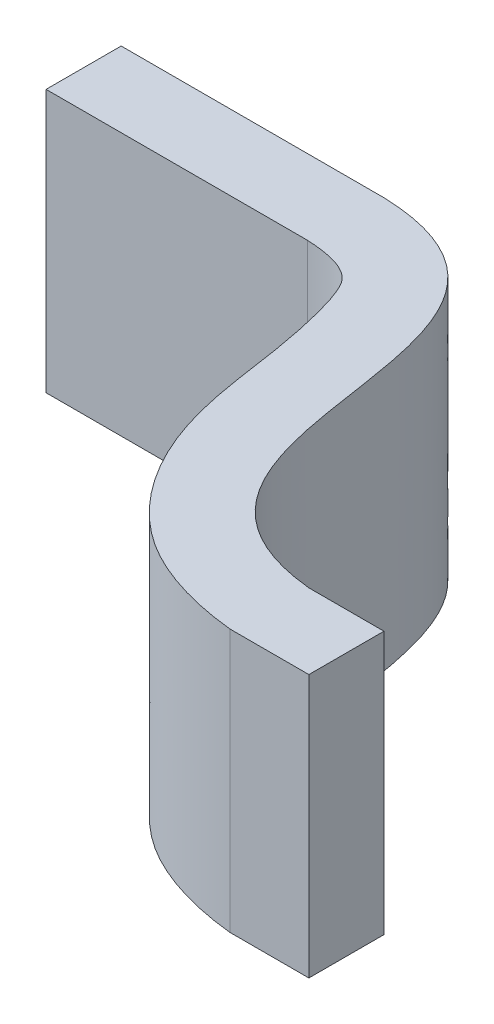
ISO-10303-21;
HEADER;
FILE_DESCRIPTION(('STEP AP214'),'2;1');
FILE_NAME('part.step','',(''),(''),'','','');
FILE_SCHEMA(('AUTOMOTIVE_DESIGN { 1 0 10303 214 1 1 1 1 }'));
ENDSEC;
DATA;
#1=APPLICATION_CONTEXT('core data for automotive mechanical design processes');
#2=APPLICATION_PROTOCOL_DEFINITION('international standard','automotive_design',2000,#1);
#3=PRODUCT_CONTEXT('',#1,'mechanical');
#4=PRODUCT('Part','Part','',(#3));
#5=PRODUCT_RELATED_PRODUCT_CATEGORY('part','',(#4));
#6=PRODUCT_DEFINITION_FORMATION('','',#4);
#7=PRODUCT_DEFINITION_CONTEXT('part definition',#1,'design');
#8=PRODUCT_DEFINITION('design','',#6,#7);
#9=PRODUCT_DEFINITION_SHAPE('','',#8);
#10=(LENGTH_UNIT() NAMED_UNIT(*) SI_UNIT(.MILLI.,.METRE.));
#11=(NAMED_UNIT(*) PLANE_ANGLE_UNIT() SI_UNIT($,.RADIAN.));
#12=(NAMED_UNIT(*) SI_UNIT($,.STERADIAN.) SOLID_ANGLE_UNIT());
#13=UNCERTAINTY_MEASURE_WITH_UNIT(LENGTH_MEASURE(1.E-05),#10,'distance_accuracy_value','');
#14=(GEOMETRIC_REPRESENTATION_CONTEXT(3) GLOBAL_UNCERTAINTY_ASSIGNED_CONTEXT((#13)) GLOBAL_UNIT_ASSIGNED_CONTEXT((#10,
#11,#12)) REPRESENTATION_CONTEXT('',''));
#15=CARTESIAN_POINT('',(0.,0.,0.));
#16=DIRECTION('',(0.,0.,1.));
#17=DIRECTION('',(1.,0.,0.));
#18=AXIS2_PLACEMENT_3D('',#15,#16,#17);
#19=CARTESIAN_POINT('',(0.381074398756027,-1.47690082967439,1.19999994098963));
#20=DIRECTION('',(0.,-1.,-4.37113882867379E-08));
#21=DIRECTION('',(1.,0.,0.));
#22=AXIS2_PLACEMENT_3D('',#19,#20,#21);
#23=PLANE('',#22);
#24=CARTESIAN_POINT('',(-6.65392560124397,-1.47690082093211,0.999999940989626));
#25=CARTESIAN_POINT('',(-6.6760213847098,-1.47690082083689,0.997821450801579));
#26=CARTESIAN_POINT('',(-6.69813368756547,-1.4769008206928,0.994525079742581));
#27=CARTESIAN_POINT('',(-6.74194760453987,-1.47690082027531,0.984974087228831));
#28=CARTESIAN_POINT('',(-6.76364199343851,-1.4769008200005,0.978687220868853));
#29=CARTESIAN_POINT('',(-6.8010868913745,-1.47690081936799,0.964217149326461));
#30=CARTESIAN_POINT('',(-6.81710358266756,-1.47690081904135,0.95674424510406));
#31=CARTESIAN_POINT('',(-6.84769864594612,-1.47690081828303,0.939395998406591));
#32=CARTESIAN_POINT('',(-6.86228342605002,-1.47690081785186,0.929532115974731));
#33=CARTESIAN_POINT('',(-6.88912475678651,-1.47690081690445,0.90785790812502));
#34=CARTESIAN_POINT('',(-6.90144309560176,-1.47690081639156,0.896124168112708));
#35=CARTESIAN_POINT('',(-6.92409093426443,-1.47690081528685,0.870851289617719));
#36=CARTESIAN_POINT('',(-6.93441702178863,-1.4769008146949,0.8573091196093));
#37=CARTESIAN_POINT('',(-6.96671116783855,-1.47690081254812,0.808196481414674));
#38=CARTESIAN_POINT('',(-6.98363339651492,-1.47690081085059,0.769361496281231));
#39=CARTESIAN_POINT('',(-7.00636675343762,-1.47690080782166,0.700067708109997));
#40=CARTESIAN_POINT('',(-7.01392037587509,-1.47690080650928,0.670043959191938));
#41=CARTESIAN_POINT('',(-7.02679822502436,-1.476900803861,0.609458378700427));
#42=CARTESIAN_POINT('',(-7.03211866901882,-1.47690080252507,0.578895724783763));
#43=CARTESIAN_POINT('',(-7.04522373011164,-1.47690079894623,0.497021439048199));
#44=CARTESIAN_POINT('',(-7.05225323067938,-1.47690079669872,0.445604616201524));
#45=CARTESIAN_POINT('',(-7.06582589653957,-1.47690079334914,0.368975133259856));
#46=CARTESIAN_POINT('',(-7.07085237182357,-1.47690079223664,0.343524166788314));
#47=CARTESIAN_POINT('',(-7.08288891244714,-1.47690079003342,0.293120289033239));
#48=CARTESIAN_POINT('',(-7.0898957194452,-1.47690078894266,0.268166631105824));
#49=CARTESIAN_POINT('',(-7.10753002382366,-1.47690078676159,0.21826958117502));
#50=CARTESIAN_POINT('',(-7.11829723428463,-1.47690078567323,0.193370641435785));
#51=CARTESIAN_POINT('',(-7.13813270077437,-1.47690078413505,0.158181201453988));
#52=CARTESIAN_POINT('',(-7.14532993400949,-1.47690078363948,0.146843907751022));
#53=CARTESIAN_POINT('',(-7.16104748346313,-1.47690078269053,0.125134493644533));
#54=CARTESIAN_POINT('',(-7.1695665343253,-1.47690078223712,0.114761465194491));
#55=CARTESIAN_POINT('',(-7.19090199977994,-1.47690078124645,0.0920975480052605));
#56=CARTESIAN_POINT('',(-7.20421803422598,-1.47690078072935,0.0802679863135944));
#57=CARTESIAN_POINT('',(-7.23279289498045,-1.47690077980915,0.0592161697720432));
#58=CARTESIAN_POINT('',(-7.24805496936829,-1.47690077940623,0.0499983589534031));
#59=CARTESIAN_POINT('',(-7.28054440722777,-1.47690077870131,0.0338717762435272));
#60=CARTESIAN_POINT('',(-7.29782779482495,-1.47690077840435,0.0270780966533525));
#61=CARTESIAN_POINT('',(-7.33319650573112,-1.47690077791998,0.0159970143758726));
#62=CARTESIAN_POINT('',(-7.35128360657443,-1.47690077773283,0.0117154982372892));
#63=CARTESIAN_POINT('',(-7.38352182929289,-1.4769007774817,0.00597045282360228));
#64=CARTESIAN_POINT('',(-7.39760256337062,-1.47690077739915,0.00408176859856485));
#65=CARTESIAN_POINT('',(-7.4257638425411,-1.4769007772789,0.00133077820343936));
#66=CARTESIAN_POINT('',(-7.43984365839325,-1.47690077724089,0.000461176785631797));
#67=CARTESIAN_POINT('',(-7.45392560124401,-1.47690077722073,-5.90103753674717E-08));
#68=B_SPLINE_CURVE_WITH_KNOTS('',3,(#24,#25,#26,#27,#28,#29,#30,#31,#32,#33,#34,#35,#36,#37,#38,
#39,#40,#41,#42,#43,#44,#45,#46,#47,#48,#49,#50,#51,#52,#53,#54,#55,#56,#57,#58,#59,#60,#61,#62,
#63,#64,#65,#66,#67),.UNSPECIFIED.,.F.,.F.,(4,2,2,2,2,2,2,2,2,2,2,2,2,2,2,2,2,2,2,2,2,4),(0.,
0.0667821137090889,0.134301214684032,0.187128508823994,0.239707439757743,0.290518731452934,
0.34141629467506,0.466712259088972,0.55956301965451,0.652570428897923,0.808245450373597,
0.886023921415196,0.963675157190788,1.04458784966541,1.08478909463837,1.12495209032638,
1.17807587168457,1.2312895104201,1.28677003517691,1.34238004906255,1.38496468867345,
1.42724258099923),.UNSPECIFIED.);
#69=CARTESIAN_POINT('',(-6.65392560124397,-1.47690082093211,0.999999940989626));
#70=VERTEX_POINT('',#69);
#71=CARTESIAN_POINT('',(-7.45392560124397,-1.47690077722073,-5.90103741870962E-08));
#72=VERTEX_POINT('',#71);
#73=EDGE_CURVE('E11',#70,#72,#68,.T.);
#74=ORIENTED_EDGE('',*,*,#73,.F.);
#75=DIRECTION('',(-1.,0.,0.));
#76=VECTOR('',#75,1.);
#77=CARTESIAN_POINT('',(-6.45392560124397,-1.47690082093211,0.999999940989626));
#78=LINE('',#77,#76);
#79=CARTESIAN_POINT('',(-6.45392560124397,-1.47690082093211,0.999999940989626));
#80=VERTEX_POINT('',#79);
#81=EDGE_CURVE('E179',#80,#70,#78,.T.);
#82=ORIENTED_EDGE('',*,*,#81,.F.);
#83=DIRECTION('',(0.,4.37113878426487E-08,-0.999999999999999));
#84=VECTOR('',#83,1.);
#85=CARTESIAN_POINT('',(-6.45392560124397,-1.47690082967439,1.19999994098963));
#86=LINE('',#85,#84);
#87=CARTESIAN_POINT('',(-6.45392560124397,-1.47690082967439,1.19999994098963));
#88=VERTEX_POINT('',#87);
#89=EDGE_CURVE('E155',#88,#80,#86,.T.);
#90=ORIENTED_EDGE('',*,*,#89,.F.);
#91=DIRECTION('',(-1.,0.,0.));
#92=VECTOR('',#91,1.);
#93=CARTESIAN_POINT('',(-6.45392560124397,-1.47690082967439,1.19999994098963));
#94=LINE('',#93,#92);
#95=CARTESIAN_POINT('',(-6.66372477809197,-1.47690082967439,1.19999994098963));
#96=VERTEX_POINT('',#95);
#97=EDGE_CURVE('E148',#88,#96,#94,.T.);
#98=ORIENTED_EDGE('',*,*,#97,.T.);
#99=CARTESIAN_POINT('',(-6.66372477809197,-1.47690082967439,1.19999994098963));
#100=CARTESIAN_POINT('',(-6.68235816480651,-1.47690082959388,1.19815808766804));
#101=CARTESIAN_POINT('',(-6.70093498946342,-1.47690082948649,1.19570131124008));
#102=CARTESIAN_POINT('',(-6.73791221278168,-1.47690082921529,1.18949691165288));
#103=CARTESIAN_POINT('',(-6.75631214417819,-1.47690082905135,1.18574651415813));
#104=CARTESIAN_POINT('',(-6.79295513620438,-1.47690082866298,1.17686153782507));
#105=CARTESIAN_POINT('',(-6.8111952940445,-1.47690082843801,1.17171480363105));
#106=CARTESIAN_POINT('',(-6.84717172345389,-1.47690082792288,1.1599300109206));
#107=CARTESIAN_POINT('',(-6.86490837899947,-1.47690082763277,1.1532931252104));
#108=CARTESIAN_POINT('',(-6.90549462665057,-1.47690082686923,1.1358254120325));
#109=CARTESIAN_POINT('',(-6.92807290255751,-1.47690082636693,1.12433420692271));
#110=CARTESIAN_POINT('',(-6.97096829666688,-1.4769008252108,1.09788498679643));
#111=CARTESIAN_POINT('',(-6.9912955036889,-1.47690082455769,1.08294345008822));
#112=CARTESIAN_POINT('',(-7.02796037846709,-1.4769008231845,1.05152845303654));
#113=CARTESIAN_POINT('',(-7.04448684621663,-1.47690082247389,1.03527175701928));
#114=CARTESIAN_POINT('',(-7.0754212602201,-1.47690082096671,1.00079143835059));
#115=CARTESIAN_POINT('',(-7.08982362168071,-1.47690082016992,0.982562841549024));
#116=CARTESIAN_POINT('',(-7.11808537102814,-1.47690081841041,0.94231006002603));
#117=CARTESIAN_POINT('',(-7.1316696505039,-1.47690081743928,0.920093273546856));
#118=CARTESIAN_POINT('',(-7.15605550233222,-1.47690081543449,0.874229058403105));
#119=CARTESIAN_POINT('',(-7.16686079670802,-1.47690081440092,0.850583596236032));
#120=CARTESIAN_POINT('',(-7.18656671922941,-1.47690081220073,0.800249067769624));
#121=CARTESIAN_POINT('',(-7.19523524065515,-1.47690081103018,0.773470176491148));
#122=CARTESIAN_POINT('',(-7.20995546192352,-1.47690080865782,0.719196920615698));
#123=CARTESIAN_POINT('',(-7.21600397870322,-1.47690080745597,0.691701728512114));
#124=CARTESIAN_POINT('',(-7.22444466903982,-1.47690080548969,0.646718523761128));
#125=CARTESIAN_POINT('',(-7.22735928328766,-1.47690080472924,0.629321384546686));
#126=CARTESIAN_POINT('',(-7.23280873084802,-1.47690080320562,0.594464976282695));
#127=CARTESIAN_POINT('',(-7.235343477908,-1.47690080244245,0.577005694041488));
#128=CARTESIAN_POINT('',(-7.24043139259136,-1.47690080091635,0.54209274684554));
#129=CARTESIAN_POINT('',(-7.24298455656837,-1.47690080015343,0.524639081456819));
#130=CARTESIAN_POINT('',(-7.24852784389109,-1.47690079863081,0.489805535822996));
#131=CARTESIAN_POINT('',(-7.25151784908981,-1.47690079787111,0.472425636930945));
#132=CARTESIAN_POINT('',(-7.2593930344497,-1.47690079601736,0.430016827455336));
#133=CARTESIAN_POINT('',(-7.26452884999095,-1.47690079492524,0.405032099238832));
#134=CARTESIAN_POINT('',(-7.27334542318719,-1.47690079329834,0.367812822408358));
#135=CARTESIAN_POINT('',(-7.27647049737491,-1.47690079275781,0.355446901764326));
#136=CARTESIAN_POINT('',(-7.28323298853228,-1.47690079168299,0.330858010833505));
#137=CARTESIAN_POINT('',(-7.28687011761276,-1.47690079114869,0.318634964373175));
#138=CARTESIAN_POINT('',(-7.29334407740757,-1.47690079030675,0.299373308638715));
#139=CARTESIAN_POINT('',(-7.2959066269859,-1.47690078999513,0.292243894867463));
#140=CARTESIAN_POINT('',(-7.30148473904446,-1.47690078937999,0.278171806776026));
#141=CARTESIAN_POINT('',(-7.30449961539945,-1.47690078907645,0.271228868086334));
#142=CARTESIAN_POINT('',(-7.31076754414832,-1.47690078854203,0.258999855834236));
#143=CARTESIAN_POINT('',(-7.31387365469767,-1.47690078830808,0.253644679150387));
#144=CARTESIAN_POINT('',(-7.32080381678023,-1.47690078789996,0.244315938153897));
#145=CARTESIAN_POINT('',(-7.32450000384901,-1.47690078772199,0.240253917374159));
#146=CARTESIAN_POINT('',(-7.33394897363332,-1.47690078736597,0.232075907205086));
#147=CARTESIAN_POINT('',(-7.33998642044214,-1.47690078720367,0.228303992977284));
#148=CARTESIAN_POINT('',(-7.34920308092036,-1.4769007869739,0.223113032707355));
#149=CARTESIAN_POINT('',(-7.35228960650534,-1.47690078689985,0.221466101314977));
#150=CARTESIAN_POINT('',(-7.35857989092758,-1.47690078676952,0.218417312752189));
#151=CARTESIAN_POINT('',(-7.36178332741555,-1.47690078671318,0.217014835421492));
#152=CARTESIAN_POINT('',(-7.37090352258754,-1.47690078656539,0.213464983405925));
#153=CARTESIAN_POINT('',(-7.37693693346537,-1.47690078648195,0.21162164027106));
#154=CARTESIAN_POINT('',(-7.38670569686491,-1.47690078636659,0.209137148338985));
#155=CARTESIAN_POINT('',(-7.39039887638499,-1.47690078632738,0.208309634068496));
#156=CARTESIAN_POINT('',(-7.39781445722382,-1.47690078625907,0.206799599147103));
#157=CARTESIAN_POINT('',(-7.40153685423347,-1.47690078622998,0.206117057516811));
#158=CARTESIAN_POINT('',(-7.41389968086125,-1.47690078614021,0.204032017216309));
#159=CARTESIAN_POINT('',(-7.42257948480063,-1.47690078608826,0.202861051319937));
#160=CARTESIAN_POINT('',(-7.43563044947402,-1.47690078602745,0.201476536264861));
#161=CARTESIAN_POINT('',(-7.43998307619468,-1.47690078601004,0.201077162443524));
#162=CARTESIAN_POINT('',(-7.44869872182374,-1.47690078598158,0.20042393173629));
#163=CARTESIAN_POINT('',(-7.45306173976726,-1.47690078597053,0.200170061830806));
#164=CARTESIAN_POINT('',(-7.45742938297997,-1.476900785963,0.199999940989626));
#165=B_SPLINE_CURVE_WITH_KNOTS('',3,(#99,#100,#101,#102,#103,#104,#105,#106,#107,#108,#109,#110,
#111,#112,#113,#114,#115,#116,#117,#118,#119,#120,#121,#122,#123,#124,#125,#126,#127,#128,#129,
#130,#131,#132,#133,#134,#135,#136,#137,#138,#139,#140,#141,#142,#143,#144,#145,#146,#147,#148,
#149,#150,#151,#152,#153,#154,#155,#156,#157,#158,#159,#160,#161,#162,#163,#164),.UNSPECIFIED.,
.F.,.F.,(4,2,2,2,2,2,2,2,2,2,2,2,2,2,2,2,2,2,2,2,2,2,2,2,2,2,2,2,2,2,2,2,4),(0.,
0.0561681589095728,0.11245753438314,0.169253578612371,0.226005077906889,0.301715004036547,
0.377070566346005,0.446424912055154,0.515958475234816,0.593880428548584,0.671697467408244,
0.755964517163009,0.840333658382208,0.893247792631839,0.946173923407371,0.999089848164162,
1.05199148781442,1.12847716172405,1.16673541076623,1.20497223539784,1.22769072756634,
1.25037510056687,1.26886797593494,1.28517999290264,1.30634908955327,1.31685139211729,
1.32732665061524,1.34619861049414,1.35755137220421,1.36890248990409,1.39515927363249,
1.40827024085607,1.42138003473644),.UNSPECIFIED.);
#166=CARTESIAN_POINT('',(-7.45742938297997,-1.476900785963,0.199999940989626));
#167=VERTEX_POINT('',#166);
#168=EDGE_CURVE('E196',#96,#167,#165,.T.);
#169=ORIENTED_EDGE('',*,*,#168,.T.);
#170=DIRECTION('',(1.,0.,0.));
#171=VECTOR('',#170,1.);
#172=CARTESIAN_POINT('',(-8.15392560124397,-1.476900785963,0.199999940989624));
#173=LINE('',#172,#171);
#174=CARTESIAN_POINT('',(-8.15392560124397,-1.476900785963,0.199999940989626));
#175=VERTEX_POINT('',#174);
#176=EDGE_CURVE('E102',#175,#167,#173,.T.);
#177=ORIENTED_EDGE('',*,*,#176,.F.);
#178=DIRECTION('',(0.,4.37113878426487E-08,-0.999999999999999));
#179=VECTOR('',#178,1.);
#180=CARTESIAN_POINT('',(-8.15392560124397,-1.476900785963,0.199999940989626));
#181=LINE('',#180,#179);
#182=CARTESIAN_POINT('',(-8.15392560124397,-1.47690077722073,-5.90103741870962E-08));
#183=VERTEX_POINT('',#182);
#184=EDGE_CURVE('E90',#175,#183,#181,.T.);
#185=ORIENTED_EDGE('',*,*,#184,.T.);
#186=DIRECTION('',(-1.,0.,0.));
#187=VECTOR('',#186,1.);
#188=CARTESIAN_POINT('',(-7.45392560124397,-1.47690077722073,-5.90103741870963E-08));
#189=LINE('',#188,#187);
#190=EDGE_CURVE('E100',#72,#183,#189,.T.);
#191=ORIENTED_EDGE('',*,*,#190,.F.);
#192=EDGE_LOOP('',(#74,#82,#90,#98,#169,#177,#185,#191));
#193=FACE_BOUND('',#192,.T.);
#194=ADVANCED_FACE('F17',(#193),#23,.T.);
#195=CARTESIAN_POINT('',(0.381074398756027,-0.776900829674392,1.1999999715876));
#196=DIRECTION('',(0.,-1.,-4.37113882867379E-08));
#197=DIRECTION('',(1.,0.,0.));
#198=AXIS2_PLACEMENT_3D('',#195,#196,#197);
#199=PLANE('',#198);
#200=DIRECTION('',(-1.,0.,0.));
#201=VECTOR('',#200,1.);
#202=CARTESIAN_POINT('',(-6.45392560124397,-0.776900820932116,0.999999971587598));
#203=LINE('',#202,#201);
#204=CARTESIAN_POINT('',(-6.45392560124397,-0.776900820932114,0.999999971587598));
#205=VERTEX_POINT('',#204);
#206=CARTESIAN_POINT('',(-6.65392560124397,-0.776900820932114,0.999999971587598));
#207=VERTEX_POINT('',#206);
#208=EDGE_CURVE('E30',#205,#207,#203,.T.);
#209=ORIENTED_EDGE('',*,*,#208,.T.);
#210=CARTESIAN_POINT('',(-6.65392560124397,-0.776900820932115,0.999999971587598));
#211=CARTESIAN_POINT('',(-6.6760213847098,-0.776900820836892,0.997821481399551));
#212=CARTESIAN_POINT('',(-6.69813368756547,-0.776900820692803,0.994525110340553));
#213=CARTESIAN_POINT('',(-6.74194760453987,-0.776900820275315,0.984974117826802));
#214=CARTESIAN_POINT('',(-6.76364199343851,-0.776900820000506,0.978687251466824));
#215=CARTESIAN_POINT('',(-6.8010868913745,-0.776900819368,0.964217179924433));
#216=CARTESIAN_POINT('',(-6.81710358266756,-0.77690081904135,0.956744275702033));
#217=CARTESIAN_POINT('',(-6.84769864594612,-0.776900818283034,0.939396029004564));
#218=CARTESIAN_POINT('',(-6.86228342605002,-0.776900817851869,0.929532146572704));
#219=CARTESIAN_POINT('',(-6.88912475678651,-0.776900816904459,0.907857938722992));
#220=CARTESIAN_POINT('',(-6.90144309560176,-0.776900816391562,0.89612419871068));
#221=CARTESIAN_POINT('',(-6.92409093426443,-0.776900815286849,0.870851320215691));
#222=CARTESIAN_POINT('',(-6.93441702178863,-0.776900814694902,0.857309150207271));
#223=CARTESIAN_POINT('',(-6.96671116783855,-0.776900812548119,0.808196512012645));
#224=CARTESIAN_POINT('',(-6.98363339651492,-0.776900810850588,0.769361526879203));
#225=CARTESIAN_POINT('',(-7.00636675343762,-0.776900807821661,0.700067738707968));
#226=CARTESIAN_POINT('',(-7.01392037587509,-0.776900806509282,0.67004398978991));
#227=CARTESIAN_POINT('',(-7.02679822502435,-0.776900803861002,0.609458409298398));
#228=CARTESIAN_POINT('',(-7.03211866901882,-0.776900802525066,0.578895755381735));
#229=CARTESIAN_POINT('',(-7.04522373011164,-0.776900798946227,0.497021469646171));
#230=CARTESIAN_POINT('',(-7.05225323067938,-0.776900796698727,0.445604646799496));
#231=CARTESIAN_POINT('',(-7.06582589653957,-0.776900793349146,0.368975163857828));
#232=CARTESIAN_POINT('',(-7.07085237182357,-0.776900792236649,0.343524197386286));
#233=CARTESIAN_POINT('',(-7.08288891244714,-0.776900790033425,0.29312031963121));
#234=CARTESIAN_POINT('',(-7.0898957194452,-0.776900788942666,0.268166661703795));
#235=CARTESIAN_POINT('',(-7.10753002382366,-0.776900786761596,0.218269611772991));
#236=CARTESIAN_POINT('',(-7.11829723428463,-0.77690078567323,0.193370672033757));
#237=CARTESIAN_POINT('',(-7.13813270077437,-0.77690078413505,0.158181232051959));
#238=CARTESIAN_POINT('',(-7.14532993400949,-0.776900783639481,0.146843938348993));
#239=CARTESIAN_POINT('',(-7.16104748346313,-0.776900782690533,0.125134524242505));
#240=CARTESIAN_POINT('',(-7.1695665343253,-0.776900782237114,0.114761495792463));
#241=CARTESIAN_POINT('',(-7.19090199977994,-0.776900781246443,0.0920975786032326));
#242=CARTESIAN_POINT('',(-7.20421803422598,-0.776900780729356,0.0802680169115659));
#243=CARTESIAN_POINT('',(-7.23279289498045,-0.776900779809151,0.0592162003700146));
#244=CARTESIAN_POINT('',(-7.24805496936829,-0.776900779406228,0.0499983895513749));
#245=CARTESIAN_POINT('',(-7.28054440722777,-0.776900778701313,0.0338718068414991));
#246=CARTESIAN_POINT('',(-7.29782779482495,-0.776900778404352,0.0270781272513241));
#247=CARTESIAN_POINT('',(-7.33319650573112,-0.776900777919982,0.0159970449738442));
#248=CARTESIAN_POINT('',(-7.35128360657443,-0.776900777732831,0.011715528835261));
#249=CARTESIAN_POINT('',(-7.38352182929289,-0.776900777481707,0.00597048342157419));
#250=CARTESIAN_POINT('',(-7.39760256337062,-0.77690077739915,0.00408179919653671));
#251=CARTESIAN_POINT('',(-7.4257638425411,-0.776900777278901,0.00133080880141111));
#252=CARTESIAN_POINT('',(-7.43984365839325,-0.77690077724089,0.000461207383603498));
#253=CARTESIAN_POINT('',(-7.45392560124401,-0.776900777220728,-2.84124036111641E-08));
#254=B_SPLINE_CURVE_WITH_KNOTS('',3,(#210,#211,#212,#213,#214,#215,#216,#217,#218,#219,#220,
#221,#222,#223,#224,#225,#226,#227,#228,#229,#230,#231,#232,#233,#234,#235,#236,#237,#238,#239,
#240,#241,#242,#243,#244,#245,#246,#247,#248,#249,#250,#251,#252,#253),.UNSPECIFIED.,.F.,.F.,(4,
2,2,2,2,2,2,2,2,2,2,2,2,2,2,2,2,2,2,2,2,4),(0.,0.0667821137090889,0.134301214684032,
0.187128508823994,0.239707439757743,0.290518731452934,0.341416294675061,0.466712259088971,
0.55956301965451,0.652570428897923,0.808245450373597,0.886023921415196,0.963675157190789,
1.04458784966541,1.08478909463837,1.12495209032638,1.17807587168457,1.2312895104201,
1.28677003517691,1.34238004906255,1.38496468867345,1.42724258099923),.UNSPECIFIED.);
#255=CARTESIAN_POINT('',(-7.45392560124397,-0.776900777220726,-2.84124023863797E-08));
#256=VERTEX_POINT('',#255);
#257=EDGE_CURVE('E158',#207,#256,#254,.T.);
#258=ORIENTED_EDGE('',*,*,#257,.T.);
#259=DIRECTION('',(-1.,0.,0.));
#260=VECTOR('',#259,1.);
#261=CARTESIAN_POINT('',(-7.45392560124397,-0.776900777220728,-2.84124023863797E-08));
#262=LINE('',#261,#260);
#263=CARTESIAN_POINT('',(-8.15392560124397,-0.776900777220726,-2.84124023863797E-08));
#264=VERTEX_POINT('',#263);
#265=EDGE_CURVE('E151',#256,#264,#262,.T.);
#266=ORIENTED_EDGE('',*,*,#265,.T.);
#267=DIRECTION('',(0.,4.37113883977602E-08,-0.999999999999999));
#268=VECTOR('',#267,1.);
#269=CARTESIAN_POINT('',(-8.15392560124397,-0.776900785963004,0.199999971587598));
#270=LINE('',#269,#268);
#271=CARTESIAN_POINT('',(-8.15392560124397,-0.776900785963004,0.199999971587598));
#272=VERTEX_POINT('',#271);
#273=EDGE_CURVE('E93',#272,#264,#270,.T.);
#274=ORIENTED_EDGE('',*,*,#273,.F.);
#275=DIRECTION('',(1.,0.,0.));
#276=VECTOR('',#275,1.);
#277=CARTESIAN_POINT('',(-8.15392560124397,-0.776900785963006,0.199999971587596));
#278=LINE('',#277,#276);
#279=CARTESIAN_POINT('',(-7.45742938297997,-0.776900785963004,0.199999971587598));
#280=VERTEX_POINT('',#279);
#281=EDGE_CURVE('E193',#272,#280,#278,.T.);
#282=ORIENTED_EDGE('',*,*,#281,.T.);
#283=CARTESIAN_POINT('',(-6.66372477809197,-0.776900829674393,1.1999999715876));
#284=CARTESIAN_POINT('',(-6.68235816480651,-0.776900829593884,1.19815811826601));
#285=CARTESIAN_POINT('',(-6.70093498946342,-0.776900829486495,1.19570134183805));
#286=CARTESIAN_POINT('',(-6.73791221278168,-0.776900829215292,1.18949694225086));
#287=CARTESIAN_POINT('',(-6.75631214417819,-0.776900829051357,1.1857465447561));
#288=CARTESIAN_POINT('',(-6.79295513620438,-0.776900828662982,1.17686156842304));
#289=CARTESIAN_POINT('',(-6.8111952940445,-0.776900828438011,1.17171483422902));
#290=CARTESIAN_POINT('',(-6.84717172345389,-0.776900827922882,1.15993004151858));
#291=CARTESIAN_POINT('',(-6.86490837899947,-0.776900827632774,1.15329315580837));
#292=CARTESIAN_POINT('',(-6.90549462665057,-0.776900826869236,1.13582544263048));
#293=CARTESIAN_POINT('',(-6.92807290255751,-0.776900826366939,1.12433423752068));
#294=CARTESIAN_POINT('',(-6.97096829666688,-0.776900825210808,1.0978850173944));
#295=CARTESIAN_POINT('',(-6.9912955036889,-0.776900824557692,1.08294348068619));
#296=CARTESIAN_POINT('',(-7.02796037846709,-0.776900823184499,1.05152848363451));
#297=CARTESIAN_POINT('',(-7.04448684621663,-0.776900822473896,1.03527178761725));
#298=CARTESIAN_POINT('',(-7.0754212602201,-0.776900820966713,1.00079146894856));
#299=CARTESIAN_POINT('',(-7.08982362168071,-0.776900820169915,0.982562872146996));
#300=CARTESIAN_POINT('',(-7.11808537102814,-0.77690081841041,0.942310090624002));
#301=CARTESIAN_POINT('',(-7.1316696505039,-0.776900817439285,0.920093304144828));
#302=CARTESIAN_POINT('',(-7.15605550233222,-0.776900815434496,0.874229089001078));
#303=CARTESIAN_POINT('',(-7.16686079670802,-0.77690081440092,0.850583626834004));
#304=CARTESIAN_POINT('',(-7.18656671922941,-0.776900812200727,0.800249098367596));
#305=CARTESIAN_POINT('',(-7.19523524065515,-0.776900811030186,0.773470207089119));
#306=CARTESIAN_POINT('',(-7.20995546192352,-0.776900808657826,0.71919695121367));
#307=CARTESIAN_POINT('',(-7.21600397870321,-0.776900807455971,0.691701759110086));
#308=CARTESIAN_POINT('',(-7.22444466903982,-0.776900805489694,0.6467185543591));
#309=CARTESIAN_POINT('',(-7.22735928328766,-0.776900804729242,0.629321415144658));
#310=CARTESIAN_POINT('',(-7.23280873084802,-0.77690080320562,0.594465006880667));
#311=CARTESIAN_POINT('',(-7.235343477908,-0.776900802442451,0.57700572463946));
#312=CARTESIAN_POINT('',(-7.24043139259136,-0.776900800916357,0.542092777443511));
#313=CARTESIAN_POINT('',(-7.24298455656837,-0.776900800153433,0.52463911205479));
#314=CARTESIAN_POINT('',(-7.24852784389109,-0.776900798630811,0.489805566420967));
#315=CARTESIAN_POINT('',(-7.25151784908981,-0.776900797871112,0.472425667528916));
#316=CARTESIAN_POINT('',(-7.2593930344497,-0.776900796017363,0.430016858053307));
#317=CARTESIAN_POINT('',(-7.26452884999095,-0.776900794925243,0.405032129836802));
#318=CARTESIAN_POINT('',(-7.27334542318719,-0.776900793298341,0.367812853006329));
#319=CARTESIAN_POINT('',(-7.27647049737491,-0.776900792757813,0.355446932362297));
#320=CARTESIAN_POINT('',(-7.28323298853228,-0.776900791682989,0.330858041431478));
#321=CARTESIAN_POINT('',(-7.28687011761276,-0.77690079114869,0.318634994971147));
#322=CARTESIAN_POINT('',(-7.29334407740757,-0.776900790306762,0.299373339236687));
#323=CARTESIAN_POINT('',(-7.2959066269859,-0.776900789995145,0.292243925465434));
#324=CARTESIAN_POINT('',(-7.30148473904446,-0.776900789379978,0.278171837373998));
#325=CARTESIAN_POINT('',(-7.30449961539945,-0.776900789076417,0.271228898684306));
#326=CARTESIAN_POINT('',(-7.31076754414832,-0.776900788542058,0.258999886432208));
#327=CARTESIAN_POINT('',(-7.31387365469767,-0.77690078830818,0.253644709748359));
#328=CARTESIAN_POINT('',(-7.32080381678023,-0.776900787899872,0.244315968751869));
#329=CARTESIAN_POINT('',(-7.32450000384901,-0.776900787721683,0.240253947972131));
#330=CARTESIAN_POINT('',(-7.33394897363332,-0.776900787366467,0.232075937803058));
#331=CARTESIAN_POINT('',(-7.33998642044214,-0.776900787205584,0.228304023575256));
#332=CARTESIAN_POINT('',(-7.34920308092036,-0.776900786974223,0.223113063305327));
#333=CARTESIAN_POINT('',(-7.35228960650534,-0.776900786899041,0.221466131912949));
#334=CARTESIAN_POINT('',(-7.35857989092758,-0.77690078677033,0.218417343350161));
#335=CARTESIAN_POINT('',(-7.36178332741555,-0.776900786716747,0.217014866019463));
#336=CARTESIAN_POINT('',(-7.37090352258754,-0.776900786573024,0.213465014003898));
#337=CARTESIAN_POINT('',(-7.37693693346537,-0.776900786488011,0.211621670869032));
#338=CARTESIAN_POINT('',(-7.38670569686491,-0.776900786368905,0.209137178936957));
#339=CARTESIAN_POINT('',(-7.39039887638499,-0.77690078632802,0.208309664666468));
#340=CARTESIAN_POINT('',(-7.39781445722382,-0.776900786258443,0.206799629745075));
#341=CARTESIAN_POINT('',(-7.40153685423347,-0.77690078622975,0.206117088114783));
#342=CARTESIAN_POINT('',(-7.41389968086125,-0.776900786140739,0.204032047814281));
#343=CARTESIAN_POINT('',(-7.42257948480063,-0.776900786088365,0.202861081917908));
#344=CARTESIAN_POINT('',(-7.43563044947402,-0.776900786027402,0.201476566862832));
#345=CARTESIAN_POINT('',(-7.43998307619468,-0.776900786010019,0.201077193041496));
#346=CARTESIAN_POINT('',(-7.44869872182374,-0.776900785981613,0.200423962334262));
#347=CARTESIAN_POINT('',(-7.45306173976726,-0.77690078597059,0.200170092428778));
#348=CARTESIAN_POINT('',(-7.45742938297997,-0.776900785963005,0.199999971587598));
#349=B_SPLINE_CURVE_WITH_KNOTS('',3,(#283,#284,#285,#286,#287,#288,#289,#290,#291,#292,#293,
#294,#295,#296,#297,#298,#299,#300,#301,#302,#303,#304,#305,#306,#307,#308,#309,#310,#311,#312,
#313,#314,#315,#316,#317,#318,#319,#320,#321,#322,#323,#324,#325,#326,#327,#328,#329,#330,#331,
#332,#333,#334,#335,#336,#337,#338,#339,#340,#341,#342,#343,#344,#345,#346,#347,#348),
.UNSPECIFIED.,.F.,.F.,(4,2,2,2,2,2,2,2,2,2,2,2,2,2,2,2,2,2,2,2,2,2,2,2,2,2,2,2,2,2,2,2,4),(0.,
0.0561681589095726,0.11245753438314,0.169253578612371,0.226005077906885,0.301715004036546,
0.377070566346006,0.446424912055155,0.515958475234817,0.593880428548585,0.671697467408244,
0.755964517163009,0.840333658382209,0.893247792631839,0.946173923407372,0.999089848164163,
1.05199148781442,1.12847716172405,1.16673541076623,1.20497223539784,1.22769072756634,
1.25037510056687,1.26886797593494,1.28517999290264,1.30634908955327,1.3168513921173,
1.32732665061524,1.34619861049414,1.35755137220421,1.36890248990409,1.39515927363249,
1.40827024085607,1.42138003473644),.UNSPECIFIED.);
#350=CARTESIAN_POINT('',(-6.66372477809197,-0.776900829674392,1.1999999715876));
#351=VERTEX_POINT('',#350);
#352=EDGE_CURVE('E98',#351,#280,#349,.T.);
#353=ORIENTED_EDGE('',*,*,#352,.F.);
#354=DIRECTION('',(-1.,0.,0.));
#355=VECTOR('',#354,1.);
#356=CARTESIAN_POINT('',(-6.45392560124397,-0.776900829674394,1.1999999715876));
#357=LINE('',#356,#355);
#358=CARTESIAN_POINT('',(-6.45392560124397,-0.776900829674392,1.1999999715876));
#359=VERTEX_POINT('',#358);
#360=EDGE_CURVE('E164',#359,#351,#357,.T.);
#361=ORIENTED_EDGE('',*,*,#360,.F.);
#362=DIRECTION('',(0.,4.37113883977602E-08,-0.999999999999999));
#363=VECTOR('',#362,1.);
#364=CARTESIAN_POINT('',(-6.45392560124397,-0.776900829674392,1.1999999715876));
#365=LINE('',#364,#363);
#366=EDGE_CURVE('E197',#359,#205,#365,.T.);
#367=ORIENTED_EDGE('',*,*,#366,.T.);
#368=EDGE_LOOP('',(#209,#258,#266,#274,#282,#353,#361,#367));
#369=FACE_BOUND('',#368,.T.);
#370=ADVANCED_FACE('F121',(#369),#199,.F.);
#371=CARTESIAN_POINT('',(0.381074398756027,-0.126900829674392,1.2));
#372=DIRECTION('',(0.,-4.37113882867379E-08,1.));
#373=DIRECTION('',(0.,-1.,-4.37113882867379E-08));
#374=AXIS2_PLACEMENT_3D('',#371,#372,#373);
#375=PLANE('',#374);
#376=ORIENTED_EDGE('',*,*,#360,.T.);
#377=DIRECTION('',(0.,-0.999999999999999,-4.37113881598553E-08));
#378=VECTOR('',#377,1.);
#379=CARTESIAN_POINT('',(-6.66372477809197,-0.776900829674392,1.1999999715876));
#380=LINE('',#379,#378);
#381=EDGE_CURVE('E153',#351,#96,#380,.T.);
#382=ORIENTED_EDGE('',*,*,#381,.T.);
#383=ORIENTED_EDGE('',*,*,#97,.F.);
#384=DIRECTION('',(0.,0.999999999999999,4.37113881598553E-08));
#385=VECTOR('',#384,1.);
#386=CARTESIAN_POINT('',(-6.45392560124397,-1.47690082967439,1.19999994098963));
#387=LINE('',#386,#385);
#388=EDGE_CURVE('E191',#88,#359,#387,.T.);
#389=ORIENTED_EDGE('',*,*,#388,.T.);
#390=EDGE_LOOP('',(#376,#382,#383,#389));
#391=FACE_BOUND('',#390,.T.);
#392=ADVANCED_FACE('F172',(#391),#375,.T.);
#393=CARTESIAN_POINT('',(-6.45392560124397,-0.126900829674392,1.2));
#394=DIRECTION('',(-1.,0.,0.));
#395=DIRECTION('',(0.,-1.,-4.37113882867379E-08));
#396=AXIS2_PLACEMENT_3D('',#393,#394,#395);
#397=PLANE('',#396);
#398=ORIENTED_EDGE('',*,*,#89,.T.);
#399=DIRECTION('',(0.,-0.999999999999999,-4.37113881598551E-08));
#400=VECTOR('',#399,1.);
#401=CARTESIAN_POINT('',(-6.45392560124397,-0.776900820932113,0.999999971587598));
#402=LINE('',#401,#400);
#403=EDGE_CURVE('E140',#205,#80,#402,.T.);
#404=ORIENTED_EDGE('',*,*,#403,.F.);
#405=ORIENTED_EDGE('',*,*,#366,.F.);
#406=ORIENTED_EDGE('',*,*,#388,.F.);
#407=EDGE_LOOP('',(#398,#404,#405,#406));
#408=FACE_BOUND('',#407,.T.);
#409=ADVANCED_FACE('F209',(#408),#397,.F.);
#410=CARTESIAN_POINT('',(-8.15392560124397,-0.126900829674392,1.2));
#411=DIRECTION('',(-1.,0.,0.));
#412=DIRECTION('',(0.,-1.,-4.37113882867379E-08));
#413=AXIS2_PLACEMENT_3D('',#410,#411,#412);
#414=PLANE('',#413);
#415=DIRECTION('',(0.,-0.999999999999999,-4.37113883184584E-08));
#416=VECTOR('',#415,1.);
#417=CARTESIAN_POINT('',(-8.15392560124397,-0.776900785963002,0.199999971587598));
#418=LINE('',#417,#416);
#419=EDGE_CURVE('E146',#272,#175,#418,.T.);
#420=ORIENTED_EDGE('',*,*,#419,.F.);
#421=ORIENTED_EDGE('',*,*,#273,.T.);
#422=DIRECTION('',(0.,0.999999999999999,4.37113882867379E-08));
#423=VECTOR('',#422,1.);
#424=CARTESIAN_POINT('',(-8.15392560124397,-1.47690077722073,-5.90103741870962E-08));
#425=LINE('',#424,#423);
#426=EDGE_CURVE('E87',#183,#264,#425,.T.);
#427=ORIENTED_EDGE('',*,*,#426,.F.);
#428=ORIENTED_EDGE('',*,*,#184,.F.);
#429=EDGE_LOOP('',(#420,#421,#427,#428));
#430=FACE_BOUND('',#429,.T.);
#431=ADVANCED_FACE('F89',(#430),#414,.T.);
#432=CARTESIAN_POINT('',(0.381074398756027,-0.126900777220726,0.));
#433=DIRECTION('',(0.,-4.37113882867379E-08,1.));
#434=DIRECTION('',(0.,-1.,-4.37113882867379E-08));
#435=AXIS2_PLACEMENT_3D('',#432,#433,#434);
#436=PLANE('',#435);
#437=ORIENTED_EDGE('',*,*,#265,.F.);
#438=DIRECTION('',(0.,-0.999999999999999,-4.37113882867379E-08));
#439=VECTOR('',#438,1.);
#440=CARTESIAN_POINT('',(-7.45392560124397,-0.776900777220726,-2.84124023863797E-08));
#441=LINE('',#440,#439);
#442=EDGE_CURVE('E97',#256,#72,#441,.T.);
#443=ORIENTED_EDGE('',*,*,#442,.T.);
#444=ORIENTED_EDGE('',*,*,#190,.T.);
#445=ORIENTED_EDGE('',*,*,#426,.T.);
#446=EDGE_LOOP('',(#437,#443,#444,#445));
#447=FACE_BOUND('',#446,.T.);
#448=ADVANCED_FACE('F105',(#447),#436,.F.);
#449=CARTESIAN_POINT('',(0.381074398756027,5.01772964056189,1.00000022487894));
#450=DIRECTION('',(0.,-4.37113882867379E-08,1.));
#451=DIRECTION('',(0.,-1.,-4.37113882867379E-08));
#452=AXIS2_PLACEMENT_3D('',#449,#450,#451);
#453=PLANE('',#452);
#454=ORIENTED_EDGE('',*,*,#81,.T.);
#455=DIRECTION('',(0.,-0.999999999999999,-4.37113881598551E-08));
#456=VECTOR('',#455,1.);
#457=CARTESIAN_POINT('',(-6.65392560124397,-0.776900820932113,0.999999971587598));
#458=LINE('',#457,#456);
#459=EDGE_CURVE('E103',#207,#70,#458,.T.);
#460=ORIENTED_EDGE('',*,*,#459,.F.);
#461=ORIENTED_EDGE('',*,*,#208,.F.);
#462=ORIENTED_EDGE('',*,*,#403,.T.);
#463=EDGE_LOOP('',(#454,#460,#461,#462));
#464=FACE_BOUND('',#463,.T.);
#465=ADVANCED_FACE('F170',(#464),#453,.F.);
#466=CARTESIAN_POINT('',(-6.65392560124397,5.01772964056189,1.00000022487894));
#467=CARTESIAN_POINT('',(-7.29924299938797,5.01772964333266,0.93661226287194));
#468=CARTESIAN_POINT('',(-6.78982889187097,5.01772968333384,0.0214920441178097));
#469=CARTESIAN_POINT('',(-7.45392560124397,5.01772968427327,2.24878939694144E-07));
#470=B_SPLINE_CURVE_WITH_KNOTS('',3,(#466,#467,#468,#469),.UNSPECIFIED.,.F.,.F.,(4,4),(0.,1.),.UNSPECIFIED.);
#471=DIRECTION('',(0.,-0.999999999999999,-4.37113882867379E-08));
#472=VECTOR('',#471,1.);
#473=SURFACE_OF_LINEAR_EXTRUSION('',#470,#472);
#474=ORIENTED_EDGE('',*,*,#73,.T.);
#475=ORIENTED_EDGE('',*,*,#442,.F.);
#476=ORIENTED_EDGE('',*,*,#257,.F.);
#477=ORIENTED_EDGE('',*,*,#459,.T.);
#478=EDGE_LOOP('',(#474,#475,#476,#477));
#479=FACE_BOUND('',#478,.T.);
#480=ADVANCED_FACE('F166',(#479),#473,.F.);
#481=CARTESIAN_POINT('',(0.381074398756027,5.017729675531,0.20000022487894));
#482=DIRECTION('',(0.,4.37113882867379E-08,-1.));
#483=DIRECTION('',(1.,0.,0.));
#484=AXIS2_PLACEMENT_3D('',#481,#482,#483);
#485=PLANE('',#484);
#486=ORIENTED_EDGE('',*,*,#176,.T.);
#487=DIRECTION('',(0.,-0.999999999999999,-4.37113883184584E-08));
#488=VECTOR('',#487,1.);
#489=CARTESIAN_POINT('',(-7.45742938297997,-0.776900785963002,0.199999971587598));
#490=LINE('',#489,#488);
#491=EDGE_CURVE('E107',#280,#167,#490,.T.);
#492=ORIENTED_EDGE('',*,*,#491,.F.);
#493=ORIENTED_EDGE('',*,*,#281,.F.);
#494=ORIENTED_EDGE('',*,*,#419,.T.);
#495=EDGE_LOOP('',(#486,#492,#493,#494));
#496=FACE_BOUND('',#495,.T.);
#497=ADVANCED_FACE('F129',(#496),#485,.F.);
#498=CARTESIAN_POINT('',(-6.66372477809197,5.01772963181961,1.20000022487894));
#499=CARTESIAN_POINT('',(-6.76109917959897,5.0177296322377,1.19043537372094));
#500=CARTESIAN_POINT('',(-6.96544759492897,5.01772963465043,1.13523848292794));
#501=CARTESIAN_POINT('',(-7.20604035748997,5.01772964683219,0.85655227210794));
#502=CARTESIAN_POINT('',(-7.23833742725997,5.01772966268883,0.49379478761794));
#503=CARTESIAN_POINT('',(-7.29818549189797,5.01772967295241,0.25899132482694));
#504=CARTESIAN_POINT('',(-7.33604209899997,5.01772967426447,0.22897490490494));
#505=CARTESIAN_POINT('',(-7.37898312658797,5.01772967516896,0.20828275194794));
#506=CARTESIAN_POINT('',(-7.43389149863997,5.01772967549165,0.20090043049794));
#507=CARTESIAN_POINT('',(-7.45742938297997,5.017729675531,0.20000022487894));
#508=B_SPLINE_CURVE_WITH_KNOTS('',3,(#498,#499,#500,#501,#502,#503,#504,#505,#506,#507),
.UNSPECIFIED.,.F.,.F.,(4,1,1,1,1,1,1,4),(-0.005037439357121,0.120331553469,0.245700546295,
0.496438531947,0.747176517599,0.872545510425,0.935230006838,0.997914503251),.UNSPECIFIED.);
#509=DIRECTION('',(0.,-0.999999999999999,-4.37113882867379E-08));
#510=VECTOR('',#509,1.);
#511=SURFACE_OF_LINEAR_EXTRUSION('',#508,#510);
#512=ORIENTED_EDGE('',*,*,#381,.F.);
#513=ORIENTED_EDGE('',*,*,#352,.T.);
#514=ORIENTED_EDGE('',*,*,#491,.T.);
#515=ORIENTED_EDGE('',*,*,#168,.F.);
#516=EDGE_LOOP('',(#512,#513,#514,#515));
#517=FACE_BOUND('',#516,.T.);
#518=ADVANCED_FACE('F123',(#517),#511,.T.);
#519=CLOSED_SHELL('',(#194,#370,#392,#409,#431,#448,#465,#480,#497,#518));
#520=MANIFOLD_SOLID_BREP('B1',#519);
#521=ADVANCED_BREP_SHAPE_REPRESENTATION('',(#18,#520),#14);
#522=SHAPE_DEFINITION_REPRESENTATION(#9,#521);
ENDSEC;
END-ISO-10303-21;
